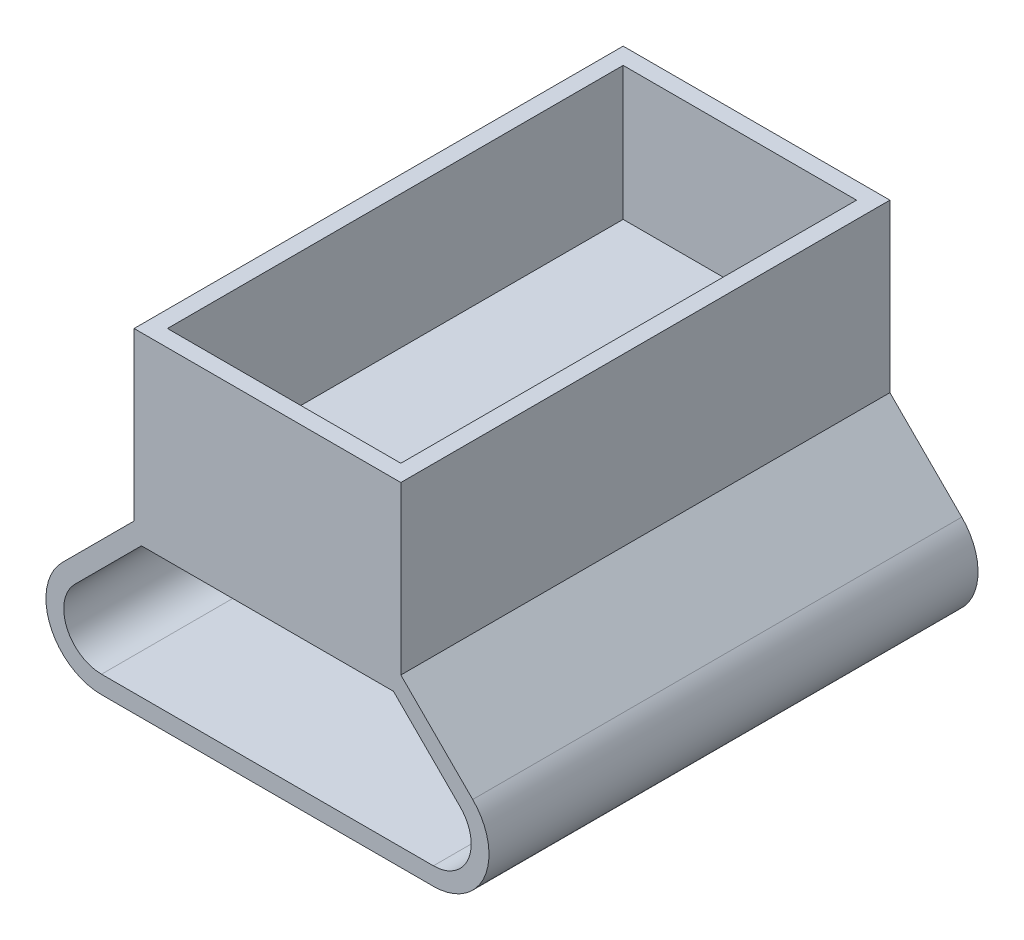
ISO-10303-21;
HEADER;
FILE_DESCRIPTION(('STEP AP214'),'2;1');
FILE_NAME('part.step','',(''),(''),'','','');
FILE_SCHEMA(('AUTOMOTIVE_DESIGN { 1 0 10303 214 1 1 1 1 }'));
ENDSEC;
DATA;
#1=APPLICATION_CONTEXT('core data for automotive mechanical design processes');
#2=APPLICATION_PROTOCOL_DEFINITION('international standard','automotive_design',2000,#1);
#3=PRODUCT_CONTEXT('',#1,'mechanical');
#4=PRODUCT('Part','Part','',(#3));
#5=PRODUCT_RELATED_PRODUCT_CATEGORY('part','',(#4));
#6=PRODUCT_DEFINITION_FORMATION('','',#4);
#7=PRODUCT_DEFINITION_CONTEXT('part definition',#1,'design');
#8=PRODUCT_DEFINITION('design','',#6,#7);
#9=PRODUCT_DEFINITION_SHAPE('','',#8);
#10=(LENGTH_UNIT() NAMED_UNIT(*) SI_UNIT(.MILLI.,.METRE.));
#11=(NAMED_UNIT(*) PLANE_ANGLE_UNIT() SI_UNIT($,.RADIAN.));
#12=(NAMED_UNIT(*) SI_UNIT($,.STERADIAN.) SOLID_ANGLE_UNIT());
#13=UNCERTAINTY_MEASURE_WITH_UNIT(LENGTH_MEASURE(1.E-05),#10,'distance_accuracy_value','');
#14=(GEOMETRIC_REPRESENTATION_CONTEXT(3) GLOBAL_UNCERTAINTY_ASSIGNED_CONTEXT((#13)) GLOBAL_UNIT_ASSIGNED_CONTEXT((#10,
#11,#12)) REPRESENTATION_CONTEXT('',''));
#15=CARTESIAN_POINT('',(0.,0.,0.));
#16=DIRECTION('',(0.,0.,1.));
#17=DIRECTION('',(1.,0.,0.));
#18=AXIS2_PLACEMENT_3D('',#15,#16,#17);
#19=CARTESIAN_POINT('',(-11.9999999999999,0.,44.));
#20=DIRECTION('',(0.707106781186544,-0.707106781186551,0.));
#21=DIRECTION('',(0.707106781186551,0.707106781186544,0.));
#22=AXIS2_PLACEMENT_3D('',#19,#20,#21);
#23=PLANE('',#22);
#24=DIRECTION('',(-0.707106781186551,-0.707106781186544,0.));
#25=VECTOR('',#24,1.);
#26=CARTESIAN_POINT('',(-11.9999999999999,0.,0.));
#27=LINE('',#26,#25);
#28=CARTESIAN_POINT('',(-11.9999999999999,0.,0.));
#29=VERTEX_POINT('',#28);
#30=CARTESIAN_POINT('',(-18.4644660940673,-6.46446609406726,0.));
#31=VERTEX_POINT('',#30);
#32=EDGE_CURVE('E256',#29,#31,#27,.T.);
#33=ORIENTED_EDGE('',*,*,#32,.T.);
#34=DIRECTION('',(0.,0.,-1.));
#35=VECTOR('',#34,1.);
#36=CARTESIAN_POINT('',(-18.4644660940673,-6.46446609406726,44.));
#37=LINE('',#36,#35);
#38=CARTESIAN_POINT('',(-18.4644660940673,-6.46446609406726,44.));
#39=VERTEX_POINT('',#38);
#40=EDGE_CURVE('E11',#39,#31,#37,.T.);
#41=ORIENTED_EDGE('',*,*,#40,.F.);
#42=DIRECTION('',(-0.707106781186551,-0.707106781186544,0.));
#43=VECTOR('',#42,1.);
#44=CARTESIAN_POINT('',(-11.9999999999999,0.,44.));
#45=LINE('',#44,#43);
#46=CARTESIAN_POINT('',(-11.9999999999999,0.,44.));
#47=VERTEX_POINT('',#46);
#48=EDGE_CURVE('E267',#47,#39,#45,.T.);
#49=ORIENTED_EDGE('',*,*,#48,.F.);
#50=DIRECTION('',(0.,0.,-1.));
#51=VECTOR('',#50,1.);
#52=CARTESIAN_POINT('',(-11.9999999999999,0.,44.));
#53=LINE('',#52,#51);
#54=EDGE_CURVE('E279',#47,#29,#53,.T.);
#55=ORIENTED_EDGE('',*,*,#54,.T.);
#56=EDGE_LOOP('',(#33,#41,#49,#55));
#57=FACE_BOUND('',#56,.T.);
#58=ADVANCED_FACE('F37',(#57),#23,.F.);
#59=CARTESIAN_POINT('',(-14.9289321881346,-10.,44.));
#60=DIRECTION('',(0.,0.,-1.));
#61=DIRECTION('',(-1.,0.,0.));
#62=AXIS2_PLACEMENT_3D('',#59,#60,#61);
#63=CYLINDRICAL_SURFACE('',#62,4.99999999999999);
#64=CARTESIAN_POINT('',(-14.9289321881346,-10.,0.));
#65=DIRECTION('',(0.,0.,1.));
#66=DIRECTION('',(1.,0.,0.));
#67=AXIS2_PLACEMENT_3D('',#64,#65,#66);
#68=CIRCLE('',#67,4.99999999999999);
#69=CARTESIAN_POINT('',(-14.9289321881345,-15.0000000000001,0.));
#70=VERTEX_POINT('',#69);
#71=EDGE_CURVE('E282',#31,#70,#68,.T.);
#72=ORIENTED_EDGE('',*,*,#71,.T.);
#73=DIRECTION('',(0.,0.,-1.));
#74=VECTOR('',#73,1.);
#75=CARTESIAN_POINT('',(-14.9289321881345,-15.0000000000001,44.));
#76=LINE('',#75,#74);
#77=CARTESIAN_POINT('',(-14.9289321881345,-15.0000000000001,44.));
#78=VERTEX_POINT('',#77);
#79=EDGE_CURVE('E44',#78,#70,#76,.T.);
#80=ORIENTED_EDGE('',*,*,#79,.F.);
#81=CARTESIAN_POINT('',(-14.9289321881346,-10.,44.));
#82=DIRECTION('',(0.,0.,1.));
#83=DIRECTION('',(1.,0.,0.));
#84=AXIS2_PLACEMENT_3D('',#81,#82,#83);
#85=CIRCLE('',#84,4.99999999999999);
#86=EDGE_CURVE('E270',#39,#78,#85,.T.);
#87=ORIENTED_EDGE('',*,*,#86,.F.);
#88=ORIENTED_EDGE('',*,*,#40,.T.);
#89=EDGE_LOOP('',(#72,#80,#87,#88));
#90=FACE_BOUND('',#89,.T.);
#91=ADVANCED_FACE('F324',(#90),#63,.T.);
#92=CARTESIAN_POINT('',(-14.9289321881345,-15.0000000000001,44.));
#93=DIRECTION('',(0.,1.,0.));
#94=DIRECTION('',(-1.,0.,0.));
#95=AXIS2_PLACEMENT_3D('',#92,#93,#94);
#96=PLANE('',#95);
#97=DIRECTION('',(1.,0.,0.));
#98=VECTOR('',#97,1.);
#99=CARTESIAN_POINT('',(-14.9289321881345,-15.0000000000001,0.));
#100=LINE('',#99,#98);
#101=CARTESIAN_POINT('',(14.9289321881346,-15.,0.));
#102=VERTEX_POINT('',#101);
#103=EDGE_CURVE('E284',#70,#102,#100,.T.);
#104=ORIENTED_EDGE('',*,*,#103,.T.);
#105=DIRECTION('',(0.,0.,-1.));
#106=VECTOR('',#105,1.);
#107=CARTESIAN_POINT('',(14.9289321881346,-15.,44.));
#108=LINE('',#107,#106);
#109=CARTESIAN_POINT('',(14.9289321881346,-15.,44.));
#110=VERTEX_POINT('',#109);
#111=EDGE_CURVE('E297',#110,#102,#108,.T.);
#112=ORIENTED_EDGE('',*,*,#111,.F.);
#113=DIRECTION('',(1.,0.,0.));
#114=VECTOR('',#113,1.);
#115=CARTESIAN_POINT('',(-14.9289321881345,-15.0000000000001,44.));
#116=LINE('',#115,#114);
#117=EDGE_CURVE('E273',#78,#110,#116,.T.);
#118=ORIENTED_EDGE('',*,*,#117,.F.);
#119=ORIENTED_EDGE('',*,*,#79,.T.);
#120=EDGE_LOOP('',(#104,#112,#118,#119));
#121=FACE_BOUND('',#120,.T.);
#122=ADVANCED_FACE('F304',(#121),#96,.F.);
#123=CARTESIAN_POINT('',(14.9289321881346,-10.,44.));
#124=DIRECTION('',(0.,0.,-1.));
#125=DIRECTION('',(-1.,0.,0.));
#126=AXIS2_PLACEMENT_3D('',#123,#124,#125);
#127=CYLINDRICAL_SURFACE('',#126,5.);
#128=CARTESIAN_POINT('',(14.9289321881346,-10.,0.));
#129=DIRECTION('',(0.,0.,1.));
#130=DIRECTION('',(1.,0.,0.));
#131=AXIS2_PLACEMENT_3D('',#128,#129,#130);
#132=CIRCLE('',#131,5.);
#133=CARTESIAN_POINT('',(18.4644660940673,-6.46446609406726,0.));
#134=VERTEX_POINT('',#133);
#135=EDGE_CURVE('E286',#102,#134,#132,.T.);
#136=ORIENTED_EDGE('',*,*,#135,.T.);
#137=DIRECTION('',(0.,0.,-1.));
#138=VECTOR('',#137,1.);
#139=CARTESIAN_POINT('',(18.4644660940673,-6.46446609406726,44.));
#140=LINE('',#139,#138);
#141=CARTESIAN_POINT('',(18.4644660940673,-6.46446609406726,44.));
#142=VERTEX_POINT('',#141);
#143=EDGE_CURVE('E294',#142,#134,#140,.T.);
#144=ORIENTED_EDGE('',*,*,#143,.F.);
#145=CARTESIAN_POINT('',(14.9289321881346,-10.,44.));
#146=DIRECTION('',(0.,0.,1.));
#147=DIRECTION('',(1.,0.,0.));
#148=AXIS2_PLACEMENT_3D('',#145,#146,#147);
#149=CIRCLE('',#148,5.);
#150=EDGE_CURVE('E275',#110,#142,#149,.T.);
#151=ORIENTED_EDGE('',*,*,#150,.F.);
#152=ORIENTED_EDGE('',*,*,#111,.T.);
#153=EDGE_LOOP('',(#136,#144,#151,#152));
#154=FACE_BOUND('',#153,.T.);
#155=ADVANCED_FACE('F313',(#154),#127,.T.);
#156=CARTESIAN_POINT('',(18.4644660940673,-6.46446609406726,44.));
#157=DIRECTION('',(-0.707106781186546,-0.707106781186549,0.));
#158=DIRECTION('',(0.707106781186549,-0.707106781186546,0.));
#159=AXIS2_PLACEMENT_3D('',#156,#157,#158);
#160=PLANE('',#159);
#161=DIRECTION('',(-0.707106781186549,0.707106781186546,0.));
#162=VECTOR('',#161,1.);
#163=CARTESIAN_POINT('',(18.4644660940673,-6.46446609406726,0.));
#164=LINE('',#163,#162);
#165=CARTESIAN_POINT('',(12.,0.,0.));
#166=VERTEX_POINT('',#165);
#167=EDGE_CURVE('E271',#134,#166,#164,.T.);
#168=ORIENTED_EDGE('',*,*,#167,.T.);
#169=DIRECTION('',(0.,0.,-1.));
#170=VECTOR('',#169,1.);
#171=CARTESIAN_POINT('',(12.,0.,44.));
#172=LINE('',#171,#170);
#173=CARTESIAN_POINT('',(12.,0.,44.));
#174=VERTEX_POINT('',#173);
#175=EDGE_CURVE('E291',#174,#166,#172,.T.);
#176=ORIENTED_EDGE('',*,*,#175,.F.);
#177=DIRECTION('',(-0.707106781186549,0.707106781186546,0.));
#178=VECTOR('',#177,1.);
#179=CARTESIAN_POINT('',(18.4644660940673,-6.46446609406726,44.));
#180=LINE('',#179,#178);
#181=EDGE_CURVE('E277',#142,#174,#180,.T.);
#182=ORIENTED_EDGE('',*,*,#181,.F.);
#183=ORIENTED_EDGE('',*,*,#143,.T.);
#184=EDGE_LOOP('',(#168,#176,#182,#183));
#185=FACE_BOUND('',#184,.T.);
#186=ADVANCED_FACE('F317',(#185),#160,.F.);
#187=CARTESIAN_POINT('',(-14.9289321881346,-10.,44.));
#188=DIRECTION('',(0.,0.,1.));
#189=DIRECTION('',(1.,0.,0.));
#190=AXIS2_PLACEMENT_3D('',#187,#188,#189);
#191=PLANE('',#190);
#192=CARTESIAN_POINT('',(14.9289321881346,-10.,44.));
#193=DIRECTION('',(0.,0.,1.));
#194=DIRECTION('',(1.,0.,0.));
#195=AXIS2_PLACEMENT_3D('',#192,#193,#194);
#196=CIRCLE('',#195,3.4);
#197=CARTESIAN_POINT('',(14.9289321881346,-13.4,44.));
#198=VERTEX_POINT('',#197);
#199=CARTESIAN_POINT('',(17.3330952441688,-7.59583694396573,44.));
#200=VERTEX_POINT('',#199);
#201=EDGE_CURVE('E218',#198,#200,#196,.T.);
#202=ORIENTED_EDGE('',*,*,#201,.F.);
#203=DIRECTION('',(1.,0.,0.));
#204=VECTOR('',#203,1.);
#205=CARTESIAN_POINT('',(-14.9289321881345,-13.4,44.));
#206=LINE('',#205,#204);
#207=CARTESIAN_POINT('',(-14.9289321881345,-13.4,44.));
#208=VERTEX_POINT('',#207);
#209=EDGE_CURVE('E223',#208,#198,#206,.T.);
#210=ORIENTED_EDGE('',*,*,#209,.F.);
#211=CARTESIAN_POINT('',(-14.9289321881346,-10.,44.));
#212=DIRECTION('',(0.,0.,1.));
#213=DIRECTION('',(1.,0.,0.));
#214=AXIS2_PLACEMENT_3D('',#211,#212,#213);
#215=CIRCLE('',#214,3.40000000000002);
#216=CARTESIAN_POINT('',(-17.3330952441689,-7.59583694396574,44.));
#217=VERTEX_POINT('',#216);
#218=EDGE_CURVE('E249',#217,#208,#215,.T.);
#219=ORIENTED_EDGE('',*,*,#218,.F.);
#220=DIRECTION('',(-0.707106781186559,-0.707106781186536,0.));
#221=VECTOR('',#220,1.);
#222=CARTESIAN_POINT('',(-11.337258300203,-1.60000000000009,44.));
#223=LINE('',#222,#221);
#224=CARTESIAN_POINT('',(-11.337258300203,-1.60000000000009,44.));
#225=VERTEX_POINT('',#224);
#226=EDGE_CURVE('E246',#225,#217,#223,.T.);
#227=ORIENTED_EDGE('',*,*,#226,.F.);
#228=DIRECTION('',(-1.,0.,0.));
#229=VECTOR('',#228,1.);
#230=CARTESIAN_POINT('',(11.3372583002031,-1.6,44.));
#231=LINE('',#230,#229);
#232=CARTESIAN_POINT('',(11.3372583002031,-1.6,44.));
#233=VERTEX_POINT('',#232);
#234=EDGE_CURVE('E243',#233,#225,#231,.T.);
#235=ORIENTED_EDGE('',*,*,#234,.F.);
#236=DIRECTION('',(-0.707106781186549,0.707106781186546,0.));
#237=VECTOR('',#236,1.);
#238=CARTESIAN_POINT('',(17.3330952441688,-7.59583694396573,44.));
#239=LINE('',#238,#237);
#240=EDGE_CURVE('E240',#200,#233,#239,.T.);
#241=ORIENTED_EDGE('',*,*,#240,.F.);
#242=EDGE_LOOP('',(#202,#210,#219,#227,#235,#241));
#243=FACE_BOUND('',#242,.T.);
#244=ORIENTED_EDGE('',*,*,#48,.T.);
#245=ORIENTED_EDGE('',*,*,#86,.T.);
#246=ORIENTED_EDGE('',*,*,#117,.T.);
#247=ORIENTED_EDGE('',*,*,#150,.T.);
#248=ORIENTED_EDGE('',*,*,#181,.T.);
#249=DIRECTION('',(0.,-1.,0.));
#250=VECTOR('',#249,1.);
#251=CARTESIAN_POINT('',(11.9999999999999,15.0000000000001,44.));
#252=LINE('',#251,#250);
#253=CARTESIAN_POINT('',(11.9999999999999,15.0000000000001,44.));
#254=VERTEX_POINT('',#253);
#255=EDGE_CURVE('E212',#254,#174,#252,.T.);
#256=ORIENTED_EDGE('',*,*,#255,.F.);
#257=DIRECTION('',(1.,0.,0.));
#258=VECTOR('',#257,1.);
#259=CARTESIAN_POINT('',(-12.0000000000001,14.9999999999999,44.));
#260=LINE('',#259,#258);
#261=CARTESIAN_POINT('',(-12.0000000000001,14.9999999999999,44.));
#262=VERTEX_POINT('',#261);
#263=EDGE_CURVE('E200',#262,#254,#260,.T.);
#264=ORIENTED_EDGE('',*,*,#263,.F.);
#265=DIRECTION('',(0.,-1.,0.));
#266=VECTOR('',#265,1.);
#267=CARTESIAN_POINT('',(-12.0000000000001,14.9999999999999,44.));
#268=LINE('',#267,#266);
#269=EDGE_CURVE('E215',#262,#47,#268,.T.);
#270=ORIENTED_EDGE('',*,*,#269,.T.);
#271=EDGE_LOOP('',(#244,#245,#246,#247,#248,#256,#264,#270));
#272=FACE_BOUND('',#271,.T.);
#273=ADVANCED_FACE('F321',(#243,#272),#191,.T.);
#274=CARTESIAN_POINT('',(-14.9289321881346,-10.,0.));
#275=DIRECTION('',(0.,0.,1.));
#276=DIRECTION('',(1.,0.,0.));
#277=AXIS2_PLACEMENT_3D('',#274,#275,#276);
#278=PLANE('',#277);
#279=DIRECTION('',(1.,0.,0.));
#280=VECTOR('',#279,1.);
#281=CARTESIAN_POINT('',(-14.9289321881345,-13.4,0.));
#282=LINE('',#281,#280);
#283=CARTESIAN_POINT('',(-14.9289321881345,-13.4,0.));
#284=VERTEX_POINT('',#283);
#285=CARTESIAN_POINT('',(14.9289321881346,-13.4,0.));
#286=VERTEX_POINT('',#285);
#287=EDGE_CURVE('E235',#284,#286,#282,.T.);
#288=ORIENTED_EDGE('',*,*,#287,.T.);
#289=CARTESIAN_POINT('',(14.9289321881346,-10.,0.));
#290=DIRECTION('',(0.,0.,1.));
#291=DIRECTION('',(1.,0.,0.));
#292=AXIS2_PLACEMENT_3D('',#289,#290,#291);
#293=CIRCLE('',#292,3.4);
#294=CARTESIAN_POINT('',(17.3330952441688,-7.59583694396573,0.));
#295=VERTEX_POINT('',#294);
#296=EDGE_CURVE('E219',#286,#295,#293,.T.);
#297=ORIENTED_EDGE('',*,*,#296,.T.);
#298=DIRECTION('',(-0.707106781186549,0.707106781186546,0.));
#299=VECTOR('',#298,1.);
#300=CARTESIAN_POINT('',(17.3330952441688,-7.59583694396573,0.));
#301=LINE('',#300,#299);
#302=CARTESIAN_POINT('',(11.3372583002031,-1.6,0.));
#303=VERTEX_POINT('',#302);
#304=EDGE_CURVE('E222',#295,#303,#301,.T.);
#305=ORIENTED_EDGE('',*,*,#304,.T.);
#306=DIRECTION('',(-1.,0.,0.));
#307=VECTOR('',#306,1.);
#308=CARTESIAN_POINT('',(11.3372583002031,-1.6,0.));
#309=LINE('',#308,#307);
#310=CARTESIAN_POINT('',(-11.337258300203,-1.60000000000009,0.));
#311=VERTEX_POINT('',#310);
#312=EDGE_CURVE('E226',#303,#311,#309,.T.);
#313=ORIENTED_EDGE('',*,*,#312,.T.);
#314=DIRECTION('',(-0.707106781186559,-0.707106781186536,0.));
#315=VECTOR('',#314,1.);
#316=CARTESIAN_POINT('',(-11.337258300203,-1.60000000000009,0.));
#317=LINE('',#316,#315);
#318=CARTESIAN_POINT('',(-17.3330952441689,-7.59583694396574,0.));
#319=VERTEX_POINT('',#318);
#320=EDGE_CURVE('E229',#311,#319,#317,.T.);
#321=ORIENTED_EDGE('',*,*,#320,.T.);
#322=CARTESIAN_POINT('',(-14.9289321881346,-10.,0.));
#323=DIRECTION('',(0.,0.,1.));
#324=DIRECTION('',(1.,0.,0.));
#325=AXIS2_PLACEMENT_3D('',#322,#323,#324);
#326=CIRCLE('',#325,3.40000000000002);
#327=EDGE_CURVE('E232',#319,#284,#326,.T.);
#328=ORIENTED_EDGE('',*,*,#327,.T.);
#329=EDGE_LOOP('',(#288,#297,#305,#313,#321,#328));
#330=FACE_BOUND('',#329,.T.);
#331=ORIENTED_EDGE('',*,*,#32,.F.);
#332=DIRECTION('',(0.,-1.,0.));
#333=VECTOR('',#332,1.);
#334=CARTESIAN_POINT('',(-12.0000000000001,14.9999999999999,0.));
#335=LINE('',#334,#333);
#336=CARTESIAN_POINT('',(-12.0000000000001,14.9999999999999,0.));
#337=VERTEX_POINT('',#336);
#338=EDGE_CURVE('E206',#337,#29,#335,.T.);
#339=ORIENTED_EDGE('',*,*,#338,.F.);
#340=DIRECTION('',(-1.,0.,0.));
#341=VECTOR('',#340,1.);
#342=CARTESIAN_POINT('',(-12.0000000000001,14.9999999999999,0.));
#343=LINE('',#342,#341);
#344=CARTESIAN_POINT('',(11.9999999999999,15.0000000000001,0.));
#345=VERTEX_POINT('',#344);
#346=EDGE_CURVE('E204',#345,#337,#343,.T.);
#347=ORIENTED_EDGE('',*,*,#346,.F.);
#348=DIRECTION('',(0.,-1.,0.));
#349=VECTOR('',#348,1.);
#350=CARTESIAN_POINT('',(11.9999999999999,15.0000000000001,0.));
#351=LINE('',#350,#349);
#352=EDGE_CURVE('E209',#345,#166,#351,.T.);
#353=ORIENTED_EDGE('',*,*,#352,.T.);
#354=ORIENTED_EDGE('',*,*,#167,.F.);
#355=ORIENTED_EDGE('',*,*,#135,.F.);
#356=ORIENTED_EDGE('',*,*,#103,.F.);
#357=ORIENTED_EDGE('',*,*,#71,.F.);
#358=EDGE_LOOP('',(#331,#339,#347,#353,#354,#355,#356,#357));
#359=FACE_BOUND('',#358,.T.);
#360=ADVANCED_FACE('F309',(#330,#359),#278,.F.);
#361=CARTESIAN_POINT('',(14.9289321881346,-10.,0.));
#362=DIRECTION('',(0.,0.,1.));
#363=DIRECTION('',(1.,0.,0.));
#364=AXIS2_PLACEMENT_3D('',#361,#362,#363);
#365=CYLINDRICAL_SURFACE('',#364,3.4);
#366=ORIENTED_EDGE('',*,*,#201,.T.);
#367=DIRECTION('',(0.,0.,1.));
#368=VECTOR('',#367,1.);
#369=CARTESIAN_POINT('',(17.3330952441688,-7.59583694396573,0.));
#370=LINE('',#369,#368);
#371=EDGE_CURVE('E238',#295,#200,#370,.T.);
#372=ORIENTED_EDGE('',*,*,#371,.F.);
#373=ORIENTED_EDGE('',*,*,#296,.F.);
#374=DIRECTION('',(0.,0.,1.));
#375=VECTOR('',#374,1.);
#376=CARTESIAN_POINT('',(14.9289321881346,-13.4,0.));
#377=LINE('',#376,#375);
#378=EDGE_CURVE('E254',#286,#198,#377,.T.);
#379=ORIENTED_EDGE('',*,*,#378,.T.);
#380=EDGE_LOOP('',(#366,#372,#373,#379));
#381=FACE_BOUND('',#380,.T.);
#382=ADVANCED_FACE('F364',(#381),#365,.F.);
#383=CARTESIAN_POINT('',(-14.9289321881345,-13.4,0.));
#384=DIRECTION('',(0.,-1.,0.));
#385=DIRECTION('',(1.,0.,0.));
#386=AXIS2_PLACEMENT_3D('',#383,#384,#385);
#387=PLANE('',#386);
#388=ORIENTED_EDGE('',*,*,#209,.T.);
#389=ORIENTED_EDGE('',*,*,#378,.F.);
#390=ORIENTED_EDGE('',*,*,#287,.F.);
#391=DIRECTION('',(0.,0.,1.));
#392=VECTOR('',#391,1.);
#393=CARTESIAN_POINT('',(-14.9289321881345,-13.4,0.));
#394=LINE('',#393,#392);
#395=EDGE_CURVE('E257',#284,#208,#394,.T.);
#396=ORIENTED_EDGE('',*,*,#395,.T.);
#397=EDGE_LOOP('',(#388,#389,#390,#396));
#398=FACE_BOUND('',#397,.T.);
#399=ADVANCED_FACE('F371',(#398),#387,.F.);
#400=CARTESIAN_POINT('',(-14.9289321881346,-10.,0.));
#401=DIRECTION('',(0.,0.,1.));
#402=DIRECTION('',(1.,0.,0.));
#403=AXIS2_PLACEMENT_3D('',#400,#401,#402);
#404=CYLINDRICAL_SURFACE('',#403,3.40000000000002);
#405=ORIENTED_EDGE('',*,*,#218,.T.);
#406=ORIENTED_EDGE('',*,*,#395,.F.);
#407=ORIENTED_EDGE('',*,*,#327,.F.);
#408=DIRECTION('',(0.,0.,1.));
#409=VECTOR('',#408,1.);
#410=CARTESIAN_POINT('',(-17.3330952441689,-7.59583694396574,0.));
#411=LINE('',#410,#409);
#412=EDGE_CURVE('E259',#319,#217,#411,.T.);
#413=ORIENTED_EDGE('',*,*,#412,.T.);
#414=EDGE_LOOP('',(#405,#406,#407,#413));
#415=FACE_BOUND('',#414,.T.);
#416=ADVANCED_FACE('F384',(#415),#404,.F.);
#417=CARTESIAN_POINT('',(-11.337258300203,-1.60000000000009,0.));
#418=DIRECTION('',(-0.707106781186536,0.707106781186559,0.));
#419=DIRECTION('',(-0.707106781186559,-0.707106781186536,0.));
#420=AXIS2_PLACEMENT_3D('',#417,#418,#419);
#421=PLANE('',#420);
#422=ORIENTED_EDGE('',*,*,#226,.T.);
#423=ORIENTED_EDGE('',*,*,#412,.F.);
#424=ORIENTED_EDGE('',*,*,#320,.F.);
#425=DIRECTION('',(0.,0.,1.));
#426=VECTOR('',#425,1.);
#427=CARTESIAN_POINT('',(-11.337258300203,-1.60000000000009,0.));
#428=LINE('',#427,#426);
#429=EDGE_CURVE('E261',#311,#225,#428,.T.);
#430=ORIENTED_EDGE('',*,*,#429,.T.);
#431=EDGE_LOOP('',(#422,#423,#424,#430));
#432=FACE_BOUND('',#431,.T.);
#433=ADVANCED_FACE('F380',(#432),#421,.F.);
#434=CARTESIAN_POINT('',(11.3372583002031,-1.6,0.));
#435=DIRECTION('',(0.,1.,0.));
#436=DIRECTION('',(-1.,0.,0.));
#437=AXIS2_PLACEMENT_3D('',#434,#435,#436);
#438=PLANE('',#437);
#439=ORIENTED_EDGE('',*,*,#234,.T.);
#440=ORIENTED_EDGE('',*,*,#429,.F.);
#441=ORIENTED_EDGE('',*,*,#312,.F.);
#442=DIRECTION('',(0.,0.,1.));
#443=VECTOR('',#442,1.);
#444=CARTESIAN_POINT('',(11.3372583002031,-1.6,0.));
#445=LINE('',#444,#443);
#446=EDGE_CURVE('E263',#303,#233,#445,.T.);
#447=ORIENTED_EDGE('',*,*,#446,.T.);
#448=EDGE_LOOP('',(#439,#440,#441,#447));
#449=FACE_BOUND('',#448,.T.);
#450=ADVANCED_FACE('F376',(#449),#438,.F.);
#451=CARTESIAN_POINT('',(17.3330952441688,-7.59583694396573,0.));
#452=DIRECTION('',(0.707106781186546,0.707106781186549,0.));
#453=DIRECTION('',(-0.707106781186549,0.707106781186546,0.));
#454=AXIS2_PLACEMENT_3D('',#451,#452,#453);
#455=PLANE('',#454);
#456=ORIENTED_EDGE('',*,*,#240,.T.);
#457=ORIENTED_EDGE('',*,*,#446,.F.);
#458=ORIENTED_EDGE('',*,*,#304,.F.);
#459=ORIENTED_EDGE('',*,*,#371,.T.);
#460=EDGE_LOOP('',(#456,#457,#458,#459));
#461=FACE_BOUND('',#460,.T.);
#462=ADVANCED_FACE('F373',(#461),#455,.F.);
#463=CARTESIAN_POINT('',(-1.21032055932865E-13,15.,0.));
#464=DIRECTION('',(0.,1.,0.));
#465=DIRECTION('',(-1.,0.,0.));
#466=AXIS2_PLACEMENT_3D('',#463,#464,#465);
#467=PLANE('',#466);
#468=DIRECTION('',(0.,0.,1.));
#469=VECTOR('',#468,1.);
#470=CARTESIAN_POINT('',(-12.0000000000001,14.9999999999999,0.));
#471=LINE('',#470,#469);
#472=EDGE_CURVE('E197',#337,#262,#471,.T.);
#473=ORIENTED_EDGE('',*,*,#472,.T.);
#474=ORIENTED_EDGE('',*,*,#263,.T.);
#475=DIRECTION('',(0.,0.,-1.));
#476=VECTOR('',#475,1.);
#477=CARTESIAN_POINT('',(11.9999999999999,15.0000000000001,0.));
#478=LINE('',#477,#476);
#479=EDGE_CURVE('E202',#254,#345,#478,.T.);
#480=ORIENTED_EDGE('',*,*,#479,.T.);
#481=ORIENTED_EDGE('',*,*,#346,.T.);
#482=EDGE_LOOP('',(#473,#474,#480,#481));
#483=FACE_BOUND('',#482,.T.);
#484=DIRECTION('',(1.,0.,0.));
#485=VECTOR('',#484,1.);
#486=CARTESIAN_POINT('',(-10.5000000000001,14.9999999999999,42.5));
#487=LINE('',#486,#485);
#488=CARTESIAN_POINT('',(-10.5000000000001,14.9999999999999,42.5));
#489=VERTEX_POINT('',#488);
#490=CARTESIAN_POINT('',(10.4999999999999,15.0000000000001,42.5));
#491=VERTEX_POINT('',#490);
#492=EDGE_CURVE('E187',#489,#491,#487,.T.);
#493=ORIENTED_EDGE('',*,*,#492,.F.);
#494=DIRECTION('',(0.,0.,1.));
#495=VECTOR('',#494,1.);
#496=CARTESIAN_POINT('',(-10.5000000000001,14.9999999999999,1.49999999999999));
#497=LINE('',#496,#495);
#498=CARTESIAN_POINT('',(-10.5000000000001,14.9999999999999,1.49999999999999));
#499=VERTEX_POINT('',#498);
#500=EDGE_CURVE('E185',#499,#489,#497,.T.);
#501=ORIENTED_EDGE('',*,*,#500,.F.);
#502=DIRECTION('',(-1.,0.,0.));
#503=VECTOR('',#502,1.);
#504=CARTESIAN_POINT('',(-10.5000000000001,14.9999999999999,1.49999999999999));
#505=LINE('',#504,#503);
#506=CARTESIAN_POINT('',(10.5,15.0000000000001,1.49999999999999));
#507=VERTEX_POINT('',#506);
#508=EDGE_CURVE('E169',#507,#499,#505,.T.);
#509=ORIENTED_EDGE('',*,*,#508,.F.);
#510=DIRECTION('',(0.,0.,-1.));
#511=VECTOR('',#510,1.);
#512=CARTESIAN_POINT('',(10.4999999999999,15.0000000000001,1.49999999999999));
#513=LINE('',#512,#511);
#514=EDGE_CURVE('E189',#491,#507,#513,.T.);
#515=ORIENTED_EDGE('',*,*,#514,.F.);
#516=EDGE_LOOP('',(#493,#501,#509,#515));
#517=FACE_BOUND('',#516,.T.);
#518=ADVANCED_FACE('F334',(#483,#517),#467,.T.);
#519=CARTESIAN_POINT('',(-12.0000000000001,14.9999999999999,0.));
#520=DIRECTION('',(1.,0.,0.));
#521=DIRECTION('',(0.,1.,0.));
#522=AXIS2_PLACEMENT_3D('',#519,#520,#521);
#523=PLANE('',#522);
#524=ORIENTED_EDGE('',*,*,#54,.F.);
#525=ORIENTED_EDGE('',*,*,#269,.F.);
#526=ORIENTED_EDGE('',*,*,#472,.F.);
#527=ORIENTED_EDGE('',*,*,#338,.T.);
#528=EDGE_LOOP('',(#524,#525,#526,#527));
#529=FACE_BOUND('',#528,.T.);
#530=ADVANCED_FACE('F332',(#529),#523,.F.);
#531=CARTESIAN_POINT('',(11.9999999999999,15.0000000000001,0.));
#532=DIRECTION('',(-1.,0.,0.));
#533=DIRECTION('',(0.,-1.,0.));
#534=AXIS2_PLACEMENT_3D('',#531,#532,#533);
#535=PLANE('',#534);
#536=ORIENTED_EDGE('',*,*,#175,.T.);
#537=ORIENTED_EDGE('',*,*,#352,.F.);
#538=ORIENTED_EDGE('',*,*,#479,.F.);
#539=ORIENTED_EDGE('',*,*,#255,.T.);
#540=EDGE_LOOP('',(#536,#537,#538,#539));
#541=FACE_BOUND('',#540,.T.);
#542=ADVANCED_FACE('F338',(#541),#535,.F.);
#543=CARTESIAN_POINT('',(-10.5000000000001,14.9999999999999,1.49999999999999));
#544=DIRECTION('',(1.,0.,0.));
#545=DIRECTION('',(0.,1.,0.));
#546=AXIS2_PLACEMENT_3D('',#543,#544,#545);
#547=PLANE('',#546);
#548=DIRECTION('',(0.,0.,1.));
#549=VECTOR('',#548,1.);
#550=CARTESIAN_POINT('',(-10.5,2.99999999999992,0.));
#551=LINE('',#550,#549);
#552=CARTESIAN_POINT('',(-10.5,2.99999999999992,1.49999999999999));
#553=VERTEX_POINT('',#552);
#554=CARTESIAN_POINT('',(-10.5,3.,42.5));
#555=VERTEX_POINT('',#554);
#556=EDGE_CURVE('E175',#553,#555,#551,.T.);
#557=ORIENTED_EDGE('',*,*,#556,.F.);
#558=DIRECTION('',(0.,-1.,0.));
#559=VECTOR('',#558,1.);
#560=CARTESIAN_POINT('',(-10.5000000000001,14.9999999999999,1.49999999999999));
#561=LINE('',#560,#559);
#562=EDGE_CURVE('E163',#499,#553,#561,.T.);
#563=ORIENTED_EDGE('',*,*,#562,.F.);
#564=ORIENTED_EDGE('',*,*,#500,.T.);
#565=DIRECTION('',(0.,-1.,0.));
#566=VECTOR('',#565,1.);
#567=CARTESIAN_POINT('',(-10.5000000000001,14.9999999999999,42.5));
#568=LINE('',#567,#566);
#569=EDGE_CURVE('E177',#489,#555,#568,.T.);
#570=ORIENTED_EDGE('',*,*,#569,.T.);
#571=EDGE_LOOP('',(#557,#563,#564,#570));
#572=FACE_BOUND('',#571,.T.);
#573=ADVANCED_FACE('F176',(#572),#547,.T.);
#574=CARTESIAN_POINT('',(-10.5000000000001,14.9999999999999,42.5));
#575=DIRECTION('',(0.,0.,-1.));
#576=DIRECTION('',(-1.,0.,0.));
#577=AXIS2_PLACEMENT_3D('',#574,#575,#576);
#578=PLANE('',#577);
#579=DIRECTION('',(1.,0.,0.));
#580=VECTOR('',#579,1.);
#581=CARTESIAN_POINT('',(0.,3.,42.5));
#582=LINE('',#581,#580);
#583=CARTESIAN_POINT('',(10.5,3.00000000000009,42.5));
#584=VERTEX_POINT('',#583);
#585=EDGE_CURVE('E51',#555,#584,#582,.T.);
#586=ORIENTED_EDGE('',*,*,#585,.F.);
#587=ORIENTED_EDGE('',*,*,#569,.F.);
#588=ORIENTED_EDGE('',*,*,#492,.T.);
#589=DIRECTION('',(0.,-1.,0.));
#590=VECTOR('',#589,1.);
#591=CARTESIAN_POINT('',(10.4999999999999,15.0000000000001,42.5));
#592=LINE('',#591,#590);
#593=EDGE_CURVE('E194',#491,#584,#592,.T.);
#594=ORIENTED_EDGE('',*,*,#593,.T.);
#595=EDGE_LOOP('',(#586,#587,#588,#594));
#596=FACE_BOUND('',#595,.T.);
#597=ADVANCED_FACE('F345',(#596),#578,.T.);
#598=CARTESIAN_POINT('',(10.4999999999999,15.0000000000001,1.49999999999999));
#599=DIRECTION('',(-1.,0.,0.));
#600=DIRECTION('',(0.,-1.,0.));
#601=AXIS2_PLACEMENT_3D('',#598,#599,#600);
#602=PLANE('',#601);
#603=DIRECTION('',(0.,0.,1.));
#604=VECTOR('',#603,1.);
#605=CARTESIAN_POINT('',(10.5,3.00000000000008,0.));
#606=LINE('',#605,#604);
#607=CARTESIAN_POINT('',(10.5,3.,1.49999999999999));
#608=VERTEX_POINT('',#607);
#609=EDGE_CURVE('E59',#608,#584,#606,.T.);
#610=ORIENTED_EDGE('',*,*,#609,.T.);
#611=ORIENTED_EDGE('',*,*,#593,.F.);
#612=ORIENTED_EDGE('',*,*,#514,.T.);
#613=DIRECTION('',(0.,-1.,0.));
#614=VECTOR('',#613,1.);
#615=CARTESIAN_POINT('',(10.4999999999999,15.0000000000001,1.49999999999999));
#616=LINE('',#615,#614);
#617=EDGE_CURVE('E172',#507,#608,#616,.T.);
#618=ORIENTED_EDGE('',*,*,#617,.T.);
#619=EDGE_LOOP('',(#610,#611,#612,#618));
#620=FACE_BOUND('',#619,.T.);
#621=ADVANCED_FACE('F452',(#620),#602,.T.);
#622=CARTESIAN_POINT('',(-10.5000000000001,14.9999999999999,1.49999999999999));
#623=DIRECTION('',(0.,0.,1.));
#624=DIRECTION('',(1.,0.,0.));
#625=AXIS2_PLACEMENT_3D('',#622,#623,#624);
#626=PLANE('',#625);
#627=DIRECTION('',(1.,0.,0.));
#628=VECTOR('',#627,1.);
#629=CARTESIAN_POINT('',(0.,3.,1.49999999999999));
#630=LINE('',#629,#628);
#631=EDGE_CURVE('E167',#553,#608,#630,.T.);
#632=ORIENTED_EDGE('',*,*,#631,.T.);
#633=ORIENTED_EDGE('',*,*,#617,.F.);
#634=ORIENTED_EDGE('',*,*,#508,.T.);
#635=ORIENTED_EDGE('',*,*,#562,.T.);
#636=EDGE_LOOP('',(#632,#633,#634,#635));
#637=FACE_BOUND('',#636,.T.);
#638=ADVANCED_FACE('F165',(#637),#626,.T.);
#639=CARTESIAN_POINT('',(0.,3.,0.));
#640=DIRECTION('',(0.,1.,0.));
#641=DIRECTION('',(-1.,0.,0.));
#642=AXIS2_PLACEMENT_3D('',#639,#640,#641);
#643=PLANE('',#642);
#644=ORIENTED_EDGE('',*,*,#609,.F.);
#645=ORIENTED_EDGE('',*,*,#631,.F.);
#646=ORIENTED_EDGE('',*,*,#556,.T.);
#647=ORIENTED_EDGE('',*,*,#585,.T.);
#648=EDGE_LOOP('',(#644,#645,#646,#647));
#649=FACE_BOUND('',#648,.T.);
#650=ADVANCED_FACE('F180',(#649),#643,.T.);
#651=CLOSED_SHELL('',(#58,#91,#122,#155,#186,#273,#360,#382,#399,#416,#433,#450,#462,#518,#530,
#542,#573,#597,#621,#638,#650));
#652=MANIFOLD_SOLID_BREP('B2',#651);
#653=ADVANCED_BREP_SHAPE_REPRESENTATION('',(#18,#652),#14);
#654=SHAPE_DEFINITION_REPRESENTATION(#9,#653);
ENDSEC;
END-ISO-10303-21;
